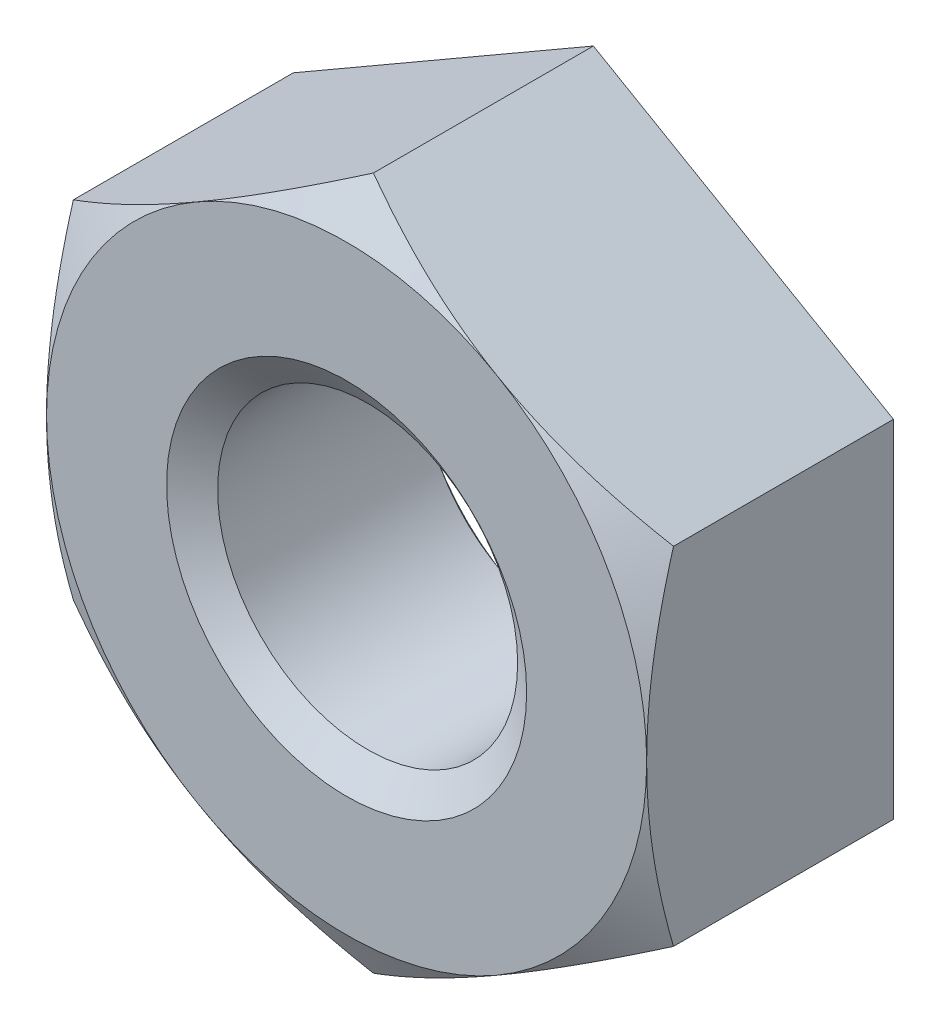
ISO-10303-21;
HEADER;
FILE_DESCRIPTION(('STEP AP214'),'2;1');
FILE_NAME('part.step','',(''),(''),'','','');
FILE_SCHEMA(('AUTOMOTIVE_DESIGN { 1 0 10303 214 1 1 1 1 }'));
ENDSEC;
DATA;
#1=APPLICATION_CONTEXT('core data for automotive mechanical design processes');
#2=APPLICATION_PROTOCOL_DEFINITION('international standard','automotive_design',2000,#1);
#3=PRODUCT_CONTEXT('',#1,'mechanical');
#4=PRODUCT('Part','Part','',(#3));
#5=PRODUCT_RELATED_PRODUCT_CATEGORY('part','',(#4));
#6=PRODUCT_DEFINITION_FORMATION('','',#4);
#7=PRODUCT_DEFINITION_CONTEXT('part definition',#1,'design');
#8=PRODUCT_DEFINITION('design','',#6,#7);
#9=PRODUCT_DEFINITION_SHAPE('','',#8);
#10=(LENGTH_UNIT() NAMED_UNIT(*) SI_UNIT(.MILLI.,.METRE.));
#11=(NAMED_UNIT(*) PLANE_ANGLE_UNIT() SI_UNIT($,.RADIAN.));
#12=(NAMED_UNIT(*) SI_UNIT($,.STERADIAN.) SOLID_ANGLE_UNIT());
#13=UNCERTAINTY_MEASURE_WITH_UNIT(LENGTH_MEASURE(1.E-05),#10,'distance_accuracy_value','');
#14=(GEOMETRIC_REPRESENTATION_CONTEXT(3) GLOBAL_UNCERTAINTY_ASSIGNED_CONTEXT((#13)) GLOBAL_UNIT_ASSIGNED_CONTEXT((#10,
#11,#12)) REPRESENTATION_CONTEXT('',''));
#15=CARTESIAN_POINT('',(0.,0.,0.));
#16=DIRECTION('',(0.,0.,1.));
#17=DIRECTION('',(1.,0.,0.));
#18=AXIS2_PLACEMENT_3D('',#15,#16,#17);
#19=CARTESIAN_POINT('',(0.,0.,-6.5278));
#20=DIRECTION('',(0.,0.,1.));
#21=DIRECTION('',(1.,0.,0.));
#22=AXIS2_PLACEMENT_3D('',#19,#20,#21);
#23=CYLINDRICAL_SURFACE('',#22,3.96875);
#24=CARTESIAN_POINT('',(0.,0.,-0.55578973345396));
#25=DIRECTION('',(0.,0.,1.));
#26=DIRECTION('',(1.,0.,0.));
#27=AXIS2_PLACEMENT_3D('',#24,#25,#26);
#28=CIRCLE('',#27,3.96875);
#29=CARTESIAN_POINT('',(3.96875,0.,-0.55578973345396));
#30=VERTEX_POINT('',#29);
#31=EDGE_CURVE('E133',#30,#30,#28,.F.);
#32=ORIENTED_EDGE('',*,*,#31,.F.);
#33=EDGE_LOOP('',(#32));
#34=FACE_BOUND('',#33,.T.);
#35=CARTESIAN_POINT('',(0.,0.,-5.94661026654604));
#36=DIRECTION('',(0.,0.,-1.));
#37=DIRECTION('',(-1.,0.,0.));
#38=AXIS2_PLACEMENT_3D('',#35,#36,#37);
#39=CIRCLE('',#38,3.96875);
#40=CARTESIAN_POINT('',(-3.96875,0.,-5.94661026654604));
#41=VERTEX_POINT('',#40);
#42=EDGE_CURVE('E39',#41,#41,#39,.F.);
#43=ORIENTED_EDGE('',*,*,#42,.F.);
#44=EDGE_LOOP('',(#43));
#45=FACE_BOUND('',#44,.T.);
#46=ADVANCED_FACE('F34',(#34,#45),#23,.F.);
#47=CARTESIAN_POINT('',(0.,9.16543552338531,-6.5278));
#48=DIRECTION('',(-0.5,0.866025403784438,0.));
#49=DIRECTION('',(-0.866025403784438,-0.500000000000001,0.));
#50=AXIS2_PLACEMENT_3D('',#47,#48,#49);
#51=PLANE('',#50);
#52=DIRECTION('',(0.,0.,1.));
#53=VECTOR('',#52,1.);
#54=CARTESIAN_POINT('',(-7.9375,4.58271776169265,-6.5278));
#55=LINE('',#54,#53);
#56=CARTESIAN_POINT('',(-7.9375,4.58271776169265,-6.5278));
#57=VERTEX_POINT('',#56);
#58=CARTESIAN_POINT('',(-7.9375,4.58271776169265,-0.708948904974019));
#59=VERTEX_POINT('',#58);
#60=EDGE_CURVE('E235',#57,#59,#55,.T.);
#61=ORIENTED_EDGE('',*,*,#60,.T.);
#62=CARTESIAN_POINT('',(-7.9377,4.58260229163882,-0.709015572900508));
#63=CARTESIAN_POINT('',(-7.76322502158794,4.68333546739188,-0.650866285897758));
#64=CARTESIAN_POINT('',(-7.58809953864739,4.78444421210956,-0.595356039210451));
#65=CARTESIAN_POINT('',(-7.23642632358313,4.98748283749369,-0.490340491808393));
#66=CARTESIAN_POINT('',(-7.05987801235103,5.08941305250852,-0.440837783112743));
#67=CARTESIAN_POINT('',(-6.52740632749457,5.39683572309625,-0.302312723142105));
#68=CARTESIAN_POINT('',(-6.16938105017108,5.60354171333566,-0.223521451359133));
#69=CARTESIAN_POINT('',(-5.63360314162951,5.91287323305799,-0.131129350120144));
#70=CARTESIAN_POINT('',(-5.45745113218674,6.01457464312807,-0.104809503727428));
#71=CARTESIAN_POINT('',(-5.10435050058568,6.21843738783397,-0.0606755611211425));
#72=CARTESIAN_POINT('',(-4.92740195020692,6.32059868102786,-0.0428607133854612));
#73=CARTESIAN_POINT('',(-4.57320017052296,6.52509717387584,-0.0161882579707898));
#74=CARTESIAN_POINT('',(-4.39594751669931,6.6274340412755,-0.00732048505625493));
#75=CARTESIAN_POINT('',(-4.04127846358522,6.83220231456415,0.00126770549347121));
#76=CARTESIAN_POINT('',(-3.86386206952291,6.93463371743467,0.00098840572957408));
#77=CARTESIAN_POINT('',(-3.53217533850329,7.12613314087548,-0.00808134398118746));
#78=CARTESIAN_POINT('',(-3.37788159577043,7.21521467477657,-0.0157654088390022));
#79=CARTESIAN_POINT('',(-3.06965548223467,7.39316910439771,-0.037902621578238));
#80=CARTESIAN_POINT('',(-2.91572313649508,7.48204198564746,-0.0523562257657454));
#81=CARTESIAN_POINT('',(-2.45452203220582,7.74831656735941,-0.105529699236185));
#82=CARTESIAN_POINT('',(-2.14806963971145,7.92524693865984,-0.154055589218097));
#83=CARTESIAN_POINT('',(-1.53191404608759,8.28098453650127,-0.2753712110733));
#84=CARTESIAN_POINT('',(-1.22228948290794,8.45974636140077,-0.34867520168915));
#85=CARTESIAN_POINT('',(-0.607657694775877,8.81460418973131,-0.51504499141565));
#86=CARTESIAN_POINT('',(-0.302642598800622,8.99070473749953,-0.60807171394554));
#87=CARTESIAN_POINT('',(0.000200000000000615,9.16555099343915,-0.709015572900511));
#88=B_SPLINE_CURVE_WITH_KNOTS('',3,(#62,#63,#64,#65,#66,#67,#68,#69,#70,#71,#72,#73,#74,#75,#76,
#77,#78,#79,#80,#81,#82,#83,#84,#85,#86,#87),.UNSPECIFIED.,.F.,.F.,(4,2,2,2,2,2,2,2,2,2,2,2,4),
(0.,0.629020687135155,1.25831181455685,2.51950872534226,3.1346613754238,3.74975965907412,
4.36415830804191,4.97853797504021,5.51339074736726,6.04827957705289,7.11881916910899,
8.21310135188791,9.30523536686631),.UNSPECIFIED.);
#89=CARTESIAN_POINT('',(-3.96875,6.87407664253898,0.));
#90=VERTEX_POINT('',#89);
#91=EDGE_CURVE('E119',#59,#90,#88,.T.);
#92=ORIENTED_EDGE('',*,*,#91,.T.);
#93=CARTESIAN_POINT('',(0.,9.16543552338531,-0.708948904974017));
#94=VERTEX_POINT('',#93);
#95=EDGE_CURVE('E145',#90,#94,#88,.T.);
#96=ORIENTED_EDGE('',*,*,#95,.T.);
#97=DIRECTION('',(0.,0.,1.));
#98=VECTOR('',#97,1.);
#99=CARTESIAN_POINT('',(0.,9.16543552338531,-6.5278));
#100=LINE('',#99,#98);
#101=CARTESIAN_POINT('',(0.,9.16543552338531,-6.5278));
#102=VERTEX_POINT('',#101);
#103=EDGE_CURVE('E247',#102,#94,#100,.T.);
#104=ORIENTED_EDGE('',*,*,#103,.F.);
#105=DIRECTION('',(-0.866025403784438,-0.500000000000001,0.));
#106=VECTOR('',#105,1.);
#107=CARTESIAN_POINT('',(0.,9.16543552338531,-6.5278));
#108=LINE('',#107,#106);
#109=EDGE_CURVE('E263',#102,#57,#108,.T.);
#110=ORIENTED_EDGE('',*,*,#109,.T.);
#111=EDGE_LOOP('',(#61,#92,#96,#104,#110));
#112=FACE_BOUND('',#111,.T.);
#113=ADVANCED_FACE('F36',(#112),#51,.T.);
#114=CARTESIAN_POINT('',(7.9375,4.58271776169265,-6.5278));
#115=DIRECTION('',(0.500000000000001,0.866025403784438,0.));
#116=DIRECTION('',(-0.866025403784438,0.500000000000001,0.));
#117=AXIS2_PLACEMENT_3D('',#114,#115,#116);
#118=PLANE('',#117);
#119=ORIENTED_EDGE('',*,*,#103,.T.);
#120=CARTESIAN_POINT('',(-0.000199999999999468,9.16555099343915,-0.70901557290051));
#121=CARTESIAN_POINT('',(0.174274978412067,9.06481781768609,-0.65086628589776));
#122=CARTESIAN_POINT('',(0.349400461352614,8.9637090729684,-0.595356039210454));
#123=CARTESIAN_POINT('',(0.701073676416868,8.76067044758427,-0.490340491808395));
#124=CARTESIAN_POINT('',(0.877621987648968,8.65874023256945,-0.440837783112745));
#125=CARTESIAN_POINT('',(1.41009367250543,8.35131756198171,-0.302312723142107));
#126=CARTESIAN_POINT('',(1.76811894982892,8.14461157174231,-0.223521451359135));
#127=CARTESIAN_POINT('',(2.30389685837049,7.83528005201998,-0.131129350120146));
#128=CARTESIAN_POINT('',(2.48004886781326,7.7335786419499,-0.104809503727429));
#129=CARTESIAN_POINT('',(2.83314949941433,7.529715897244,-0.0606755611211429));
#130=CARTESIAN_POINT('',(3.01009804979308,7.42755460405011,-0.042860713385461));
#131=CARTESIAN_POINT('',(3.36429982947704,7.22305611120213,-0.016188257970789));
#132=CARTESIAN_POINT('',(3.54155248330069,7.12071924380247,-0.00732048505625393));
#133=CARTESIAN_POINT('',(3.89622153641478,6.91595097051382,0.00126770549347221));
#134=CARTESIAN_POINT('',(4.07363793047709,6.81351956764329,0.000988405729574902));
#135=CARTESIAN_POINT('',(4.40532466149671,6.62202014420249,-0.0080813439811863));
#136=CARTESIAN_POINT('',(4.55961840422957,6.5329386103014,-0.0157654088390006));
#137=CARTESIAN_POINT('',(4.86784451776533,6.35498418068025,-0.0379026215782361));
#138=CARTESIAN_POINT('',(5.02177686350492,6.26611129943051,-0.0523562257657435));
#139=CARTESIAN_POINT('',(5.48297796779418,5.99983671771855,-0.105529699236183));
#140=CARTESIAN_POINT('',(5.78943036028855,5.82290634641812,-0.154055589218095));
#141=CARTESIAN_POINT('',(6.40558595391241,5.46716874857669,-0.275371211073298));
#142=CARTESIAN_POINT('',(6.71521051709206,5.2884069236772,-0.348675201689147));
#143=CARTESIAN_POINT('',(7.32984230522412,4.93354909534665,-0.515044991415646));
#144=CARTESIAN_POINT('',(7.63485740119938,4.75744854757844,-0.608071713945535));
#145=CARTESIAN_POINT('',(7.9377,4.58260229163881,-0.709015572900506));
#146=B_SPLINE_CURVE_WITH_KNOTS('',3,(#120,#121,#122,#123,#124,#125,#126,#127,#128,#129,#130,
#131,#132,#133,#134,#135,#136,#137,#138,#139,#140,#141,#142,#143,#144,#145),.UNSPECIFIED.,.F.,
.F.,(4,2,2,2,2,2,2,2,2,2,2,2,4),(0.,0.629020687135155,1.25831181455685,2.51950872534225,
3.1346613754238,3.74975965907412,4.36415830804191,4.97853797504021,5.51339074736726,
6.04827957705289,7.11881916910899,8.21310135188791,9.30523536686631),.UNSPECIFIED.);
#147=CARTESIAN_POINT('',(3.96875000000001,6.87407664253898,0.));
#148=VERTEX_POINT('',#147);
#149=EDGE_CURVE('E141',#94,#148,#146,.T.);
#150=ORIENTED_EDGE('',*,*,#149,.T.);
#151=CARTESIAN_POINT('',(7.9375,4.58271776169266,-0.708948904974017));
#152=VERTEX_POINT('',#151);
#153=EDGE_CURVE('E128',#148,#152,#146,.T.);
#154=ORIENTED_EDGE('',*,*,#153,.T.);
#155=DIRECTION('',(0.,0.,1.));
#156=VECTOR('',#155,1.);
#157=CARTESIAN_POINT('',(7.9375,4.58271776169265,-6.5278));
#158=LINE('',#157,#156);
#159=CARTESIAN_POINT('',(7.9375,4.58271776169265,-6.5278));
#160=VERTEX_POINT('',#159);
#161=EDGE_CURVE('E140',#160,#152,#158,.T.);
#162=ORIENTED_EDGE('',*,*,#161,.F.);
#163=DIRECTION('',(-0.866025403784438,0.500000000000001,0.));
#164=VECTOR('',#163,1.);
#165=CARTESIAN_POINT('',(7.9375,4.58271776169265,-6.5278));
#166=LINE('',#165,#164);
#167=EDGE_CURVE('E239',#160,#102,#166,.T.);
#168=ORIENTED_EDGE('',*,*,#167,.T.);
#169=EDGE_LOOP('',(#119,#150,#154,#162,#168));
#170=FACE_BOUND('',#169,.T.);
#171=ADVANCED_FACE('F215',(#170),#118,.T.);
#172=CARTESIAN_POINT('',(7.9375,4.58271776169265,-6.5278));
#173=DIRECTION('',(-1.,0.,0.));
#174=DIRECTION('',(0.,0.,1.));
#175=AXIS2_PLACEMENT_3D('',#172,#173,#174);
#176=PLANE('',#175);
#177=CARTESIAN_POINT('',(7.9375,-12.1540428550746,-3.79830572339933));
#178=CARTESIAN_POINT('',(7.9375,-11.8055417137511,-3.62989072544685));
#179=CARTESIAN_POINT('',(7.9375,-11.4562166090855,-3.46314991100219));
#180=CARTESIAN_POINT('',(7.9375,-10.7554729351181,-3.13397333785356));
#181=CARTESIAN_POINT('',(7.9375,-10.4040540160885,-2.9715383245221));
#182=CARTESIAN_POINT('',(7.9375,-9.69677883875656,-2.65107432577954));
#183=CARTESIAN_POINT('',(7.9375,-9.34090869565791,-2.49307587372592));
#184=CARTESIAN_POINT('',(7.9375,-8.62624353744266,-2.18386537817075));
#185=CARTESIAN_POINT('',(7.9375,-8.26744867594095,-2.03265298092489));
#186=CARTESIAN_POINT('',(7.9375,-7.54190895000598,-1.73702395542248));
#187=CARTESIAN_POINT('',(7.9375,-7.17512056255599,-1.59271354918167));
#188=CARTESIAN_POINT('',(7.9375,-6.43721845801434,-1.31539498874061));
#189=CARTESIAN_POINT('',(7.9375,-6.06610426490784,-1.18238809199666));
#190=CARTESIAN_POINT('',(7.9375,-5.31971777432203,-0.931250932769791));
#191=CARTESIAN_POINT('',(7.9375,-4.94445623605237,-0.813089042609606));
#192=CARTESIAN_POINT('',(7.9375,-4.1886118080749,-0.595477465323776));
#193=CARTESIAN_POINT('',(7.9375,-3.80803064222022,-0.496021860734071));
#194=CARTESIAN_POINT('',(7.9375,-3.04122341725135,-0.320658395772093));
#195=CARTESIAN_POINT('',(7.9375,-2.65499588371959,-0.244756805288598));
#196=CARTESIAN_POINT('',(7.9375,-2.07225592781296,-0.152370391651515));
#197=CARTESIAN_POINT('',(7.9375,-1.87741892555728,-0.125150577555794));
#198=CARTESIAN_POINT('',(7.9375,-1.48683143967845,-0.0784018471325876));
#199=CARTESIAN_POINT('',(7.9375,-1.29108104843294,-0.0588721694033722));
#200=CARTESIAN_POINT('',(7.9375,-0.900173147631063,-0.0280292816344224));
#201=CARTESIAN_POINT('',(7.9375,-0.705019680022207,-0.0166650499450488));
#202=CARTESIAN_POINT('',(7.9375,-0.314406625859758,-0.00221313706756053));
#203=CARTESIAN_POINT('',(7.9375,-0.118947043314487,0.000874651601978092));
#204=CARTESIAN_POINT('',(7.9375,0.271871450970607,-0.00129989647433621));
#205=CARTESIAN_POINT('',(7.9375,0.467230375568193,-0.00655988978079458));
#206=CARTESIAN_POINT('',(7.9375,0.857556246986025,-0.0252991998003125));
#207=CARTESIAN_POINT('',(7.9375,1.05252317374355,-0.0387789269758162));
#208=CARTESIAN_POINT('',(7.9375,1.52506297457966,-0.0811297065316255));
#209=CARTESIAN_POINT('',(7.9375,1.80227278881709,-0.114119139529978));
#210=CARTESIAN_POINT('',(7.9375,2.35456818411304,-0.19488378698393));
#211=CARTESIAN_POINT('',(7.9375,2.62965316433395,-0.24266303719809));
#212=CARTESIAN_POINT('',(7.9375,3.1774719495399,-0.351312741869515));
#213=CARTESIAN_POINT('',(7.9375,3.45020327611605,-0.412195574142773));
#214=CARTESIAN_POINT('',(7.9375,3.99285991142029,-0.545194835610337));
#215=CARTESIAN_POINT('',(7.9375,4.26278548193604,-0.617310206545816));
#216=CARTESIAN_POINT('',(7.9375,4.80647881225583,-0.772934354165273));
#217=CARTESIAN_POINT('',(7.9375,5.08017856871126,-0.856679077611941));
#218=CARTESIAN_POINT('',(7.9375,5.62468506827796,-1.03244298730143));
#219=CARTESIAN_POINT('',(7.9375,5.89549366465456,-1.12445646631561));
#220=CARTESIAN_POINT('',(7.9375,6.43313118794752,-1.31485725841815));
#221=CARTESIAN_POINT('',(7.9375,6.69997393537377,-1.41320578012017));
#222=CARTESIAN_POINT('',(7.9375,7.23158910056631,-1.61567532168833));
#223=CARTESIAN_POINT('',(7.9375,7.49636063153376,-1.71979867460127));
#224=CARTESIAN_POINT('',(7.9375,7.76017027676685,-1.82623818485631));
#225=B_SPLINE_CURVE_WITH_KNOTS('',3,(#177,#178,#179,#180,#181,#182,#183,#184,#185,#186,#187,
#188,#189,#190,#191,#192,#193,#194,#195,#196,#197,#198,#199,#200,#201,#202,#203,#204,#205,#206,
#207,#208,#209,#210,#211,#212,#213,#214,#215,#216,#217,#218,#219,#220,#221,#222,#223,#224),
.UNSPECIFIED.,.F.,.F.,(4,2,2,2,2,2,2,2,2,2,2,2,2,2,2,2,2,2,2,2,2,2,2,4),(0.,1.16120027580623,
2.32260027009539,3.49064648750629,4.65863174596446,5.84095623854378,7.02341208683701,
8.20330434634271,9.38282273386186,10.5626548308774,11.1527144520001,11.7427156365191,
12.328997368083,12.915271485905,13.5013810504529,14.0875198854944,14.924551061784,
15.7618108438773,16.5998650111811,17.4378402700213,18.2963561134772,19.1542838811018,
20.007382654881,20.8608286295793),.UNSPECIFIED.);
#226=CARTESIAN_POINT('',(7.9375,-4.58271776169267,-0.708948904974017));
#227=VERTEX_POINT('',#226);
#228=CARTESIAN_POINT('',(7.9375,0.,0.));
#229=VERTEX_POINT('',#228);
#230=EDGE_CURVE('E108',#227,#229,#225,.T.);
#231=ORIENTED_EDGE('',*,*,#230,.F.);
#232=DIRECTION('',(0.,0.,1.));
#233=VECTOR('',#232,1.);
#234=CARTESIAN_POINT('',(7.9375,-4.58271776169266,-6.5278));
#235=LINE('',#234,#233);
#236=CARTESIAN_POINT('',(7.9375,-4.58271776169266,-6.5278));
#237=VERTEX_POINT('',#236);
#238=EDGE_CURVE('E244',#237,#227,#235,.T.);
#239=ORIENTED_EDGE('',*,*,#238,.F.);
#240=DIRECTION('',(0.,-1.,0.));
#241=VECTOR('',#240,1.);
#242=CARTESIAN_POINT('',(7.9375,4.58271776169265,-6.5278));
#243=LINE('',#242,#241);
#244=EDGE_CURVE('E252',#160,#237,#243,.T.);
#245=ORIENTED_EDGE('',*,*,#244,.F.);
#246=ORIENTED_EDGE('',*,*,#161,.T.);
#247=EDGE_CURVE('E121',#229,#152,#225,.T.);
#248=ORIENTED_EDGE('',*,*,#247,.F.);
#249=EDGE_LOOP('',(#231,#239,#245,#246,#248));
#250=FACE_BOUND('',#249,.T.);
#251=ADVANCED_FACE('F138',(#250),#176,.F.);
#252=CARTESIAN_POINT('',(0.,-9.16543552338533,-6.5278));
#253=DIRECTION('',(0.500000000000001,-0.866025403784438,0.));
#254=DIRECTION('',(0.866025403784438,0.500000000000001,0.));
#255=AXIS2_PLACEMENT_3D('',#252,#253,#254);
#256=PLANE('',#255);
#257=ORIENTED_EDGE('',*,*,#238,.T.);
#258=CARTESIAN_POINT('',(7.9377,-4.58260229163883,-0.709015572900511));
#259=CARTESIAN_POINT('',(7.76322502158794,-4.68333546739188,-0.650866285897761));
#260=CARTESIAN_POINT('',(7.58809953864739,-4.78444421210957,-0.595356039210455));
#261=CARTESIAN_POINT('',(7.23642632358313,-4.9874828374937,-0.490340491808397));
#262=CARTESIAN_POINT('',(7.05987801235103,-5.08941305250853,-0.440837783112747));
#263=CARTESIAN_POINT('',(6.52740632749457,-5.39683572309627,-0.302312723142109));
#264=CARTESIAN_POINT('',(6.16938105017108,-5.60354171333567,-0.223521451359137));
#265=CARTESIAN_POINT('',(5.63360314162951,-5.912873233058,-0.131129350120149));
#266=CARTESIAN_POINT('',(5.45745113218674,-6.01457464312808,-0.104809503727433));
#267=CARTESIAN_POINT('',(5.10435050058567,-6.21843738783398,-0.0606755611211482));
#268=CARTESIAN_POINT('',(4.92740195020692,-6.32059868102787,-0.0428607133854659));
#269=CARTESIAN_POINT('',(4.57320017052296,-6.52509717387585,-0.0161882579707941));
#270=CARTESIAN_POINT('',(4.39594751669931,-6.62743404127551,-0.0073204850562598));
#271=CARTESIAN_POINT('',(4.04127846358522,-6.83220231456416,0.00126770549346505));
#272=CARTESIAN_POINT('',(3.86386206952291,-6.93463371743469,0.00098840572956718));
#273=CARTESIAN_POINT('',(3.53217533850329,-7.12613314087549,-0.0080813439811946));
#274=CARTESIAN_POINT('',(3.37788159577043,-7.21521467477658,-0.015765408839009));
#275=CARTESIAN_POINT('',(3.06965548223467,-7.39316910439773,-0.0379026215782447));
#276=CARTESIAN_POINT('',(2.91572313649508,-7.48204198564747,-0.0523562257657521));
#277=CARTESIAN_POINT('',(2.45452203220582,-7.74831656735943,-0.105529699236192));
#278=CARTESIAN_POINT('',(2.14806963971145,-7.92524693865986,-0.154055589218105));
#279=CARTESIAN_POINT('',(1.53191404608759,-8.28098453650128,-0.275371211073308));
#280=CARTESIAN_POINT('',(1.22228948290793,-8.45974636140078,-0.348675201689157));
#281=CARTESIAN_POINT('',(0.607657694775877,-8.81460418973133,-0.515044991415657));
#282=CARTESIAN_POINT('',(0.302642598800623,-8.99070473749954,-0.608071713945546));
#283=CARTESIAN_POINT('',(-0.000199999999999641,-9.16555099343917,-0.709015572900517));
#284=B_SPLINE_CURVE_WITH_KNOTS('',3,(#258,#259,#260,#261,#262,#263,#264,#265,#266,#267,#268,
#269,#270,#271,#272,#273,#274,#275,#276,#277,#278,#279,#280,#281,#282,#283),.UNSPECIFIED.,.F.,
.F.,(4,2,2,2,2,2,2,2,2,2,2,2,4),(0.,0.629020687135155,1.25831181455685,2.51950872534226,
3.1346613754238,3.74975965907412,4.36415830804191,4.97853797504021,5.51339074736726,
6.04827957705289,7.11881916910899,8.21310135188791,9.30523536686631),.UNSPECIFIED.);
#285=CARTESIAN_POINT('',(3.96875000000001,-6.87407664253898,0.));
#286=VERTEX_POINT('',#285);
#287=EDGE_CURVE('E114',#227,#286,#284,.T.);
#288=ORIENTED_EDGE('',*,*,#287,.T.);
#289=CARTESIAN_POINT('',(0.,-9.16543552338531,-0.708948904974017));
#290=VERTEX_POINT('',#289);
#291=EDGE_CURVE('E53',#286,#290,#284,.T.);
#292=ORIENTED_EDGE('',*,*,#291,.T.);
#293=DIRECTION('',(0.,0.,1.));
#294=VECTOR('',#293,1.);
#295=CARTESIAN_POINT('',(0.,-9.16543552338533,-6.5278));
#296=LINE('',#295,#294);
#297=CARTESIAN_POINT('',(0.,-9.16543552338533,-6.5278));
#298=VERTEX_POINT('',#297);
#299=EDGE_CURVE('E241',#298,#290,#296,.T.);
#300=ORIENTED_EDGE('',*,*,#299,.F.);
#301=DIRECTION('',(0.866025403784438,0.500000000000001,0.));
#302=VECTOR('',#301,1.);
#303=CARTESIAN_POINT('',(0.,-9.16543552338533,-6.5278));
#304=LINE('',#303,#302);
#305=EDGE_CURVE('E254',#298,#237,#304,.T.);
#306=ORIENTED_EDGE('',*,*,#305,.T.);
#307=EDGE_LOOP('',(#257,#288,#292,#300,#306));
#308=FACE_BOUND('',#307,.T.);
#309=ADVANCED_FACE('F197',(#308),#256,.T.);
#310=CARTESIAN_POINT('',(-7.9375,-4.58271776169266,-6.5278));
#311=DIRECTION('',(-0.500000000000001,-0.866025403784438,0.));
#312=DIRECTION('',(0.866025403784438,-0.500000000000001,0.));
#313=AXIS2_PLACEMENT_3D('',#310,#311,#312);
#314=PLANE('',#313);
#315=ORIENTED_EDGE('',*,*,#299,.T.);
#316=CARTESIAN_POINT('',(0.000199999999999499,-9.16555099343917,-0.709015572900517));
#317=CARTESIAN_POINT('',(-0.174274978412065,-9.0648178176861,-0.650866285897768));
#318=CARTESIAN_POINT('',(-0.349400461352613,-8.96370907296842,-0.595356039210462));
#319=CARTESIAN_POINT('',(-0.701073676416868,-8.76067044758429,-0.490340491808403));
#320=CARTESIAN_POINT('',(-0.877621987648969,-8.65874023256946,-0.440837783112753));
#321=CARTESIAN_POINT('',(-1.41009367250544,-8.35131756198172,-0.302312723142114));
#322=CARTESIAN_POINT('',(-1.76811894982892,-8.14461157174232,-0.223521451359141));
#323=CARTESIAN_POINT('',(-2.30389685837049,-7.83528005201999,-0.131129350120152));
#324=CARTESIAN_POINT('',(-2.48004886781327,-7.73357864194991,-0.104809503727436));
#325=CARTESIAN_POINT('',(-2.83314949941433,-7.52971589724401,-0.0606755611211504));
#326=CARTESIAN_POINT('',(-3.01009804979308,-7.42755460405012,-0.0428607133854677));
#327=CARTESIAN_POINT('',(-3.36429982947705,-7.22305611120214,-0.0161882579707953));
#328=CARTESIAN_POINT('',(-3.54155248330069,-7.12071924380248,-0.0073204850562605));
#329=CARTESIAN_POINT('',(-3.89622153641479,-6.91595097051383,0.00126770549346576));
#330=CARTESIAN_POINT('',(-4.07363793047709,-6.8135195676433,0.000988405729568874));
#331=CARTESIAN_POINT('',(-4.40532466149671,-6.6220201442025,-0.00808134398119252));
#332=CARTESIAN_POINT('',(-4.55961840422957,-6.53293861030141,-0.0157654088390073));
#333=CARTESIAN_POINT('',(-4.86784451776533,-6.35498418068026,-0.0379026215782427));
#334=CARTESIAN_POINT('',(-5.02177686350492,-6.26611129943052,-0.0523562257657494));
#335=CARTESIAN_POINT('',(-5.48297796779419,-5.99983671771856,-0.105529699236188));
#336=CARTESIAN_POINT('',(-5.78943036028856,-5.82290634641813,-0.154055589218101));
#337=CARTESIAN_POINT('',(-6.40558595391241,-5.4671687485767,-0.275371211073304));
#338=CARTESIAN_POINT('',(-6.71521051709207,-5.28840692367721,-0.348675201689152));
#339=CARTESIAN_POINT('',(-7.32984230522413,-4.93354909534666,-0.51504499141565));
#340=CARTESIAN_POINT('',(-7.63485740119938,-4.75744854757845,-0.608071713945538));
#341=CARTESIAN_POINT('',(-7.9377,-4.58260229163882,-0.70901557290051));
#342=B_SPLINE_CURVE_WITH_KNOTS('',3,(#316,#317,#318,#319,#320,#321,#322,#323,#324,#325,#326,
#327,#328,#329,#330,#331,#332,#333,#334,#335,#336,#337,#338,#339,#340,#341),.UNSPECIFIED.,.F.,
.F.,(4,2,2,2,2,2,2,2,2,2,2,2,4),(0.,0.629020687135156,1.25831181455685,2.51950872534226,
3.1346613754238,3.74975965907412,4.36415830804191,4.97853797504022,5.51339074736726,
6.0482795770529,7.118819169109,8.21310135188792,9.30523536686631),.UNSPECIFIED.);
#343=CARTESIAN_POINT('',(-3.96875000000001,-6.87407664253898,0.));
#344=VERTEX_POINT('',#343);
#345=EDGE_CURVE('E191',#290,#344,#342,.T.);
#346=ORIENTED_EDGE('',*,*,#345,.T.);
#347=CARTESIAN_POINT('',(-7.9375,-4.58271776169266,-0.708948904974017));
#348=VERTEX_POINT('',#347);
#349=EDGE_CURVE('E60',#344,#348,#342,.T.);
#350=ORIENTED_EDGE('',*,*,#349,.T.);
#351=DIRECTION('',(0.,0.,1.));
#352=VECTOR('',#351,1.);
#353=CARTESIAN_POINT('',(-7.9375,-4.58271776169266,-6.5278));
#354=LINE('',#353,#352);
#355=CARTESIAN_POINT('',(-7.9375,-4.58271776169266,-6.5278));
#356=VERTEX_POINT('',#355);
#357=EDGE_CURVE('E238',#356,#348,#354,.T.);
#358=ORIENTED_EDGE('',*,*,#357,.F.);
#359=DIRECTION('',(0.866025403784438,-0.500000000000001,0.));
#360=VECTOR('',#359,1.);
#361=CARTESIAN_POINT('',(-7.9375,-4.58271776169266,-6.5278));
#362=LINE('',#361,#360);
#363=EDGE_CURVE('E257',#356,#298,#362,.T.);
#364=ORIENTED_EDGE('',*,*,#363,.T.);
#365=EDGE_LOOP('',(#315,#346,#350,#358,#364));
#366=FACE_BOUND('',#365,.T.);
#367=ADVANCED_FACE('F193',(#366),#314,.T.);
#368=CARTESIAN_POINT('',(-7.9375,4.58271776169265,-6.5278));
#369=DIRECTION('',(-1.,0.,0.));
#370=DIRECTION('',(0.,0.,1.));
#371=AXIS2_PLACEMENT_3D('',#368,#369,#370);
#372=PLANE('',#371);
#373=ORIENTED_EDGE('',*,*,#357,.T.);
#374=CARTESIAN_POINT('',(-7.9375,-12.1540428550746,-3.79830572339933));
#375=CARTESIAN_POINT('',(-7.9375,-11.8055417137511,-3.62989072544685));
#376=CARTESIAN_POINT('',(-7.9375,-11.4562166090855,-3.46314991100219));
#377=CARTESIAN_POINT('',(-7.9375,-10.7554729351181,-3.13397333785355));
#378=CARTESIAN_POINT('',(-7.9375,-10.4040540160885,-2.9715383245221));
#379=CARTESIAN_POINT('',(-7.9375,-9.69677883875656,-2.65107432577954));
#380=CARTESIAN_POINT('',(-7.9375,-9.34090869565791,-2.49307587372592));
#381=CARTESIAN_POINT('',(-7.9375,-8.62624353744266,-2.18386537817075));
#382=CARTESIAN_POINT('',(-7.9375,-8.26744867594095,-2.03265298092489));
#383=CARTESIAN_POINT('',(-7.9375,-7.54190895000598,-1.73702395542248));
#384=CARTESIAN_POINT('',(-7.9375,-7.17512056255599,-1.59271354918167));
#385=CARTESIAN_POINT('',(-7.9375,-6.43721845801434,-1.31539498874061));
#386=CARTESIAN_POINT('',(-7.9375,-6.06610426490784,-1.18238809199666));
#387=CARTESIAN_POINT('',(-7.9375,-5.31971777432203,-0.93125093276979));
#388=CARTESIAN_POINT('',(-7.9375,-4.94445623605237,-0.813089042609605));
#389=CARTESIAN_POINT('',(-7.9375,-4.1886118080749,-0.595477465323775));
#390=CARTESIAN_POINT('',(-7.9375,-3.80803064222022,-0.49602186073407));
#391=CARTESIAN_POINT('',(-7.9375,-3.04122341725135,-0.320658395772092));
#392=CARTESIAN_POINT('',(-7.9375,-2.65499588371958,-0.244756805288597));
#393=CARTESIAN_POINT('',(-7.9375,-2.07225592781295,-0.152370391651514));
#394=CARTESIAN_POINT('',(-7.9375,-1.87741892555728,-0.125150577555794));
#395=CARTESIAN_POINT('',(-7.9375,-1.48683143967844,-0.0784018471325877));
#396=CARTESIAN_POINT('',(-7.9375,-1.29108104843294,-0.0588721694033722));
#397=CARTESIAN_POINT('',(-7.9375,-0.900173147631063,-0.0280292816344224));
#398=CARTESIAN_POINT('',(-7.9375,-0.705019680022208,-0.0166650499450488));
#399=CARTESIAN_POINT('',(-7.9375,-0.314406625859759,-0.00221313706756052));
#400=CARTESIAN_POINT('',(-7.9375,-0.118947043314487,0.00087465160197811));
#401=CARTESIAN_POINT('',(-7.9375,0.271871450970608,-0.00129989647433623));
#402=CARTESIAN_POINT('',(-7.9375,0.467230375568193,-0.00655988978079461));
#403=CARTESIAN_POINT('',(-7.9375,0.857556246986025,-0.0252991998003125));
#404=CARTESIAN_POINT('',(-7.9375,1.05252317374355,-0.0387789269758161));
#405=CARTESIAN_POINT('',(-7.9375,1.52506297457966,-0.0811297065316255));
#406=CARTESIAN_POINT('',(-7.9375,1.80227278881709,-0.114119139529978));
#407=CARTESIAN_POINT('',(-7.9375,2.35456818411304,-0.19488378698393));
#408=CARTESIAN_POINT('',(-7.9375,2.62965316433395,-0.24266303719809));
#409=CARTESIAN_POINT('',(-7.9375,3.1774719495399,-0.351312741869514));
#410=CARTESIAN_POINT('',(-7.9375,3.45020327611605,-0.412195574142773));
#411=CARTESIAN_POINT('',(-7.9375,3.9928599114203,-0.545194835610337));
#412=CARTESIAN_POINT('',(-7.9375,4.26278548193604,-0.617310206545817));
#413=CARTESIAN_POINT('',(-7.9375,4.80647881225584,-0.772934354165274));
#414=CARTESIAN_POINT('',(-7.9375,5.08017856871126,-0.856679077611942));
#415=CARTESIAN_POINT('',(-7.9375,5.62468506827797,-1.03244298730143));
#416=CARTESIAN_POINT('',(-7.9375,5.89549366465456,-1.12445646631561));
#417=CARTESIAN_POINT('',(-7.9375,6.43313118794752,-1.31485725841815));
#418=CARTESIAN_POINT('',(-7.9375,6.69997393537377,-1.41320578012018));
#419=CARTESIAN_POINT('',(-7.9375,7.23158910056631,-1.61567532168833));
#420=CARTESIAN_POINT('',(-7.9375,7.49636063153376,-1.71979867460127));
#421=CARTESIAN_POINT('',(-7.9375,7.76017027676685,-1.82623818485631));
#422=B_SPLINE_CURVE_WITH_KNOTS('',3,(#374,#375,#376,#377,#378,#379,#380,#381,#382,#383,#384,
#385,#386,#387,#388,#389,#390,#391,#392,#393,#394,#395,#396,#397,#398,#399,#400,#401,#402,#403,
#404,#405,#406,#407,#408,#409,#410,#411,#412,#413,#414,#415,#416,#417,#418,#419,#420,#421),
.UNSPECIFIED.,.F.,.F.,(4,2,2,2,2,2,2,2,2,2,2,2,2,2,2,2,2,2,2,2,2,2,2,4),(0.,1.16120027580623,
2.32260027009539,3.49064648750629,4.65863174596446,5.84095623854378,7.023412086837,
8.20330434634271,9.38282273386186,10.5626548308774,11.1527144520001,11.7427156365191,
12.328997368083,12.915271485905,13.5013810504529,14.0875198854944,14.924551061784,
15.7618108438773,16.5998650111811,17.4378402700213,18.2963561134772,19.1542838811018,
20.007382654881,20.8608286295793),.UNSPECIFIED.);
#423=CARTESIAN_POINT('',(-7.9375,0.,0.));
#424=VERTEX_POINT('',#423);
#425=EDGE_CURVE('E192',#348,#424,#422,.T.);
#426=ORIENTED_EDGE('',*,*,#425,.T.);
#427=EDGE_CURVE('E132',#424,#59,#422,.T.);
#428=ORIENTED_EDGE('',*,*,#427,.T.);
#429=ORIENTED_EDGE('',*,*,#60,.F.);
#430=DIRECTION('',(0.,-1.,0.));
#431=VECTOR('',#430,1.);
#432=CARTESIAN_POINT('',(-7.9375,4.58271776169265,-6.5278));
#433=LINE('',#432,#431);
#434=EDGE_CURVE('E260',#57,#356,#433,.T.);
#435=ORIENTED_EDGE('',*,*,#434,.T.);
#436=EDGE_LOOP('',(#373,#426,#428,#429,#435));
#437=FACE_BOUND('',#436,.T.);
#438=ADVANCED_FACE('F196',(#437),#372,.T.);
#439=CARTESIAN_POINT('',(-15.875,0.,0.));
#440=DIRECTION('',(0.,0.,1.));
#441=DIRECTION('',(1.,0.,0.));
#442=AXIS2_PLACEMENT_3D('',#439,#440,#441);
#443=PLANE('',#442);
#444=CARTESIAN_POINT('',(0.,0.,0.));
#445=DIRECTION('',(0.,0.,1.));
#446=DIRECTION('',(1.,0.,0.));
#447=AXIS2_PLACEMENT_3D('',#444,#445,#446);
#448=CIRCLE('',#447,4.7625);
#449=CARTESIAN_POINT('',(4.7625,0.,0.));
#450=VERTEX_POINT('',#449);
#451=EDGE_CURVE('E223',#450,#450,#448,.T.);
#452=ORIENTED_EDGE('',*,*,#451,.F.);
#453=EDGE_LOOP('',(#452));
#454=FACE_BOUND('',#453,.T.);
#455=CARTESIAN_POINT('',(0.,0.,0.));
#456=DIRECTION('',(0.,0.,1.));
#457=DIRECTION('',(1.,0.,0.));
#458=AXIS2_PLACEMENT_3D('',#455,#456,#457);
#459=CIRCLE('',#458,7.9375);
#460=EDGE_CURVE('E11',#229,#286,#459,.F.);
#461=ORIENTED_EDGE('',*,*,#460,.F.);
#462=CARTESIAN_POINT('',(0.,0.,0.));
#463=DIRECTION('',(0.,0.,1.));
#464=DIRECTION('',(1.,0.,0.));
#465=AXIS2_PLACEMENT_3D('',#462,#463,#464);
#466=CIRCLE('',#465,7.9375);
#467=EDGE_CURVE('E125',#229,#148,#466,.T.);
#468=ORIENTED_EDGE('',*,*,#467,.T.);
#469=EDGE_CURVE('E46',#90,#148,#459,.F.);
#470=ORIENTED_EDGE('',*,*,#469,.F.);
#471=EDGE_CURVE('E291',#424,#90,#459,.F.);
#472=ORIENTED_EDGE('',*,*,#471,.F.);
#473=EDGE_CURVE('E292',#344,#424,#459,.F.);
#474=ORIENTED_EDGE('',*,*,#473,.F.);
#475=EDGE_CURVE('E44',#286,#344,#459,.F.);
#476=ORIENTED_EDGE('',*,*,#475,.F.);
#477=EDGE_LOOP('',(#461,#468,#470,#472,#474,#476));
#478=FACE_BOUND('',#477,.T.);
#479=ADVANCED_FACE('F135',(#454,#478),#443,.T.);
#480=CARTESIAN_POINT('',(-15.875,0.,-6.5278));
#481=DIRECTION('',(0.,0.,1.));
#482=DIRECTION('',(1.,0.,0.));
#483=AXIS2_PLACEMENT_3D('',#480,#481,#482);
#484=PLANE('',#483);
#485=CARTESIAN_POINT('',(0.,0.,-6.5278));
#486=DIRECTION('',(0.,0.,1.));
#487=DIRECTION('',(1.,0.,0.));
#488=AXIS2_PLACEMENT_3D('',#485,#486,#487);
#489=CIRCLE('',#488,4.7625);
#490=CARTESIAN_POINT('',(4.7625,0.,-6.5278));
#491=VERTEX_POINT('',#490);
#492=EDGE_CURVE('E224',#491,#491,#489,.F.);
#493=ORIENTED_EDGE('',*,*,#492,.F.);
#494=EDGE_LOOP('',(#493));
#495=FACE_BOUND('',#494,.T.);
#496=ORIENTED_EDGE('',*,*,#109,.F.);
#497=ORIENTED_EDGE('',*,*,#167,.F.);
#498=ORIENTED_EDGE('',*,*,#244,.T.);
#499=ORIENTED_EDGE('',*,*,#305,.F.);
#500=ORIENTED_EDGE('',*,*,#363,.F.);
#501=ORIENTED_EDGE('',*,*,#434,.F.);
#502=EDGE_LOOP('',(#496,#497,#498,#499,#500,#501));
#503=FACE_BOUND('',#502,.T.);
#504=ADVANCED_FACE('F206',(#495,#503),#484,.F.);
#505=CARTESIAN_POINT('',(0.,0.,0.));
#506=DIRECTION('',(0.,0.,-1.));
#507=DIRECTION('',(-1.,0.,0.));
#508=AXIS2_PLACEMENT_3D('',#505,#506,#507);
#509=CONICAL_SURFACE('',#508,7.9375,1.0471975511966);
#510=ORIENTED_EDGE('',*,*,#467,.F.);
#511=ORIENTED_EDGE('',*,*,#247,.T.);
#512=ORIENTED_EDGE('',*,*,#153,.F.);
#513=EDGE_LOOP('',(#510,#511,#512));
#514=FACE_BOUND('',#513,.T.);
#515=ADVANCED_FACE('F126',(#514),#509,.T.);
#516=ORIENTED_EDGE('',*,*,#469,.T.);
#517=ORIENTED_EDGE('',*,*,#149,.F.);
#518=ORIENTED_EDGE('',*,*,#95,.F.);
#519=EDGE_LOOP('',(#516,#517,#518));
#520=FACE_BOUND('',#519,.T.);
#521=ADVANCED_FACE('F172',(#520),#509,.T.);
#522=ORIENTED_EDGE('',*,*,#427,.F.);
#523=ORIENTED_EDGE('',*,*,#471,.T.);
#524=ORIENTED_EDGE('',*,*,#91,.F.);
#525=EDGE_LOOP('',(#522,#523,#524));
#526=FACE_BOUND('',#525,.T.);
#527=ADVANCED_FACE('F171',(#526),#509,.T.);
#528=ORIENTED_EDGE('',*,*,#473,.T.);
#529=ORIENTED_EDGE('',*,*,#425,.F.);
#530=ORIENTED_EDGE('',*,*,#349,.F.);
#531=EDGE_LOOP('',(#528,#529,#530));
#532=FACE_BOUND('',#531,.T.);
#533=ADVANCED_FACE('F165',(#532),#509,.T.);
#534=ORIENTED_EDGE('',*,*,#475,.T.);
#535=ORIENTED_EDGE('',*,*,#345,.F.);
#536=ORIENTED_EDGE('',*,*,#291,.F.);
#537=EDGE_LOOP('',(#534,#535,#536));
#538=FACE_BOUND('',#537,.T.);
#539=ADVANCED_FACE('F170',(#538),#509,.T.);
#540=ORIENTED_EDGE('',*,*,#230,.T.);
#541=ORIENTED_EDGE('',*,*,#460,.T.);
#542=ORIENTED_EDGE('',*,*,#287,.F.);
#543=EDGE_LOOP('',(#540,#541,#542));
#544=FACE_BOUND('',#543,.T.);
#545=ADVANCED_FACE('F110',(#544),#509,.T.);
#546=CARTESIAN_POINT('',(0.,0.,-0.611368706799356));
#547=DIRECTION('',(0.,0.,1.));
#548=DIRECTION('',(1.,0.,0.));
#549=AXIS2_PLACEMENT_3D('',#546,#547,#548);
#550=CONICAL_SURFACE('',#549,3.889375,0.959931088596879);
#551=ORIENTED_EDGE('',*,*,#451,.T.);
#552=EDGE_LOOP('',(#551));
#553=FACE_BOUND('',#552,.T.);
#554=ORIENTED_EDGE('',*,*,#31,.T.);
#555=EDGE_LOOP('',(#554));
#556=FACE_BOUND('',#555,.T.);
#557=ADVANCED_FACE('F173',(#553,#556),#550,.F.);
#558=CARTESIAN_POINT('',(0.,0.,-6.5024));
#559=DIRECTION('',(0.,0.,-1.));
#560=DIRECTION('',(-1.,0.,0.));
#561=AXIS2_PLACEMENT_3D('',#558,#559,#560);
#562=CONICAL_SURFACE('',#561,4.7625,0.959931088596881);
#563=CARTESIAN_POINT('',(0.,0.,-6.5024));
#564=DIRECTION('',(0.,0.,1.));
#565=DIRECTION('',(1.,0.,0.));
#566=AXIS2_PLACEMENT_3D('',#563,#564,#565);
#567=CIRCLE('',#566,4.7625);
#568=CARTESIAN_POINT('',(4.7625,0.,-6.5024));
#569=VERTEX_POINT('',#568);
#570=EDGE_CURVE('E228',#569,#569,#567,.T.);
#571=ORIENTED_EDGE('',*,*,#570,.F.);
#572=EDGE_LOOP('',(#571));
#573=FACE_BOUND('',#572,.T.);
#574=ORIENTED_EDGE('',*,*,#42,.T.);
#575=EDGE_LOOP('',(#574));
#576=FACE_BOUND('',#575,.T.);
#577=ADVANCED_FACE('F305',(#573,#576),#562,.F.);
#578=CARTESIAN_POINT('',(0.,0.,-25.0375057290932));
#579=DIRECTION('',(0.,0.,1.));
#580=DIRECTION('',(1.,0.,0.));
#581=AXIS2_PLACEMENT_3D('',#578,#579,#580);
#582=CYLINDRICAL_SURFACE('',#581,4.7625);
#583=ORIENTED_EDGE('',*,*,#570,.T.);
#584=EDGE_LOOP('',(#583));
#585=FACE_BOUND('',#584,.T.);
#586=ORIENTED_EDGE('',*,*,#492,.T.);
#587=EDGE_LOOP('',(#586));
#588=FACE_BOUND('',#587,.T.);
#589=ADVANCED_FACE('F310',(#585,#588),#582,.F.);
#590=CLOSED_SHELL('',(#46,#113,#171,#251,#309,#367,#438,#479,#504,#515,#521,#527,#533,#539,#545,
#557,#577,#589));
#591=MANIFOLD_SOLID_BREP('B2',#590);
#592=ADVANCED_BREP_SHAPE_REPRESENTATION('',(#18,#591),#14);
#593=SHAPE_DEFINITION_REPRESENTATION(#9,#592);
ENDSEC;
END-ISO-10303-21;
